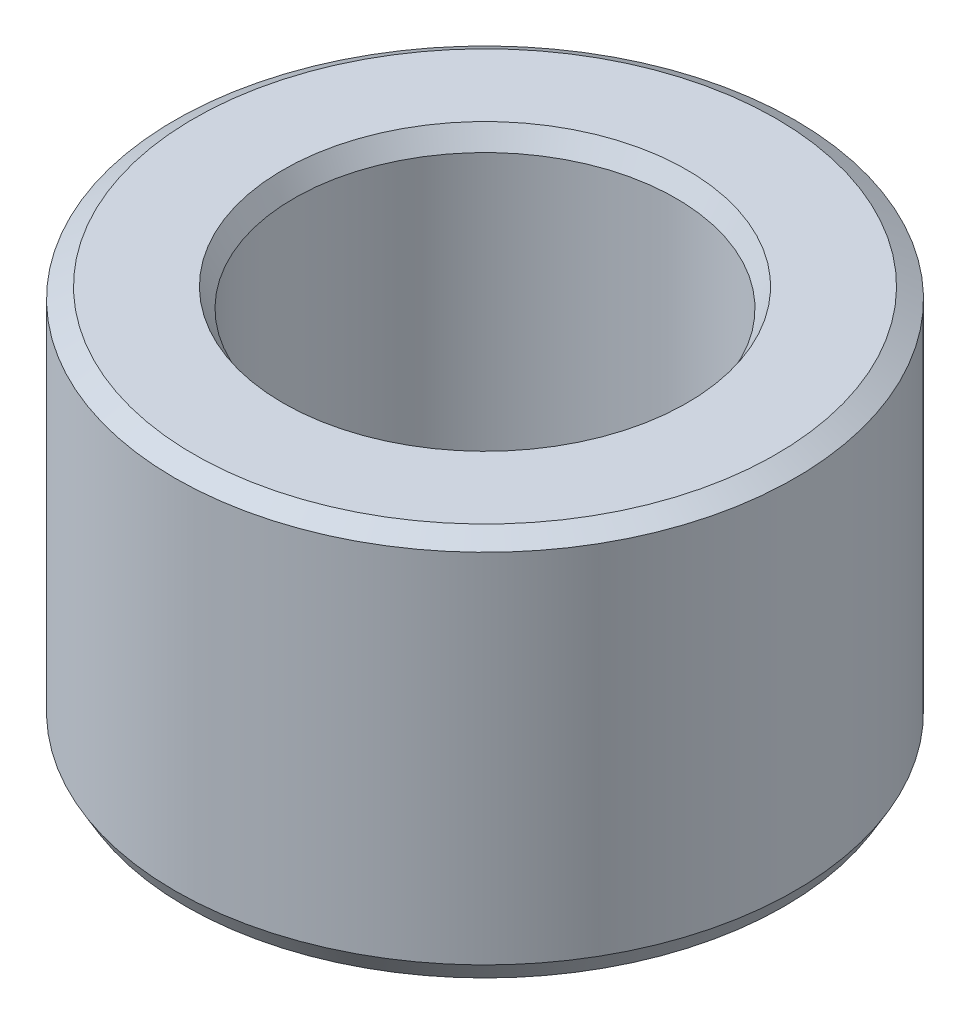
ISO-10303-21;
HEADER;
FILE_DESCRIPTION(('STEP AP214'),'2;1');
FILE_NAME('part.step','',(''),(''),'','','');
FILE_SCHEMA(('AUTOMOTIVE_DESIGN { 1 0 10303 214 1 1 1 1 }'));
ENDSEC;
DATA;
#1=APPLICATION_CONTEXT('core data for automotive mechanical design processes');
#2=APPLICATION_PROTOCOL_DEFINITION('international standard','automotive_design',2000,#1);
#3=PRODUCT_CONTEXT('',#1,'mechanical');
#4=PRODUCT('Part','Part','',(#3));
#5=PRODUCT_RELATED_PRODUCT_CATEGORY('part','',(#4));
#6=PRODUCT_DEFINITION_FORMATION('','',#4);
#7=PRODUCT_DEFINITION_CONTEXT('part definition',#1,'design');
#8=PRODUCT_DEFINITION('design','',#6,#7);
#9=PRODUCT_DEFINITION_SHAPE('','',#8);
#10=(LENGTH_UNIT() NAMED_UNIT(*) SI_UNIT(.MILLI.,.METRE.));
#11=(NAMED_UNIT(*) PLANE_ANGLE_UNIT() SI_UNIT($,.RADIAN.));
#12=(NAMED_UNIT(*) SI_UNIT($,.STERADIAN.) SOLID_ANGLE_UNIT());
#13=UNCERTAINTY_MEASURE_WITH_UNIT(LENGTH_MEASURE(1.E-05),#10,'distance_accuracy_value','');
#14=(GEOMETRIC_REPRESENTATION_CONTEXT(3) GLOBAL_UNCERTAINTY_ASSIGNED_CONTEXT((#13)) GLOBAL_UNIT_ASSIGNED_CONTEXT((#10,
#11,#12)) REPRESENTATION_CONTEXT('',''));
#15=CARTESIAN_POINT('',(0.,0.,0.));
#16=DIRECTION('',(0.,0.,1.));
#17=DIRECTION('',(1.,0.,0.));
#18=AXIS2_PLACEMENT_3D('',#15,#16,#17);
#19=CARTESIAN_POINT('',(0.,62.4750417447808,0.));
#20=DIRECTION('',(0.,-1.,0.));
#21=DIRECTION('',(0.,0.,-1.));
#22=AXIS2_PLACEMENT_3D('',#19,#20,#21);
#23=CYLINDRICAL_SURFACE('',#22,50.);
#24=CARTESIAN_POINT('',(0.,3.07506534951295,0.));
#25=DIRECTION('',(0.,1.,0.));
#26=DIRECTION('',(0.,0.,1.));
#27=AXIS2_PLACEMENT_3D('',#24,#25,#26);
#28=CIRCLE('',#27,50.);
#29=CARTESIAN_POINT('',(0.,3.07506534951295,50.));
#30=VERTEX_POINT('',#29);
#31=EDGE_CURVE('E10',#30,#30,#28,.T.);
#32=ORIENTED_EDGE('',*,*,#31,.T.);
#33=EDGE_LOOP('',(#32));
#34=FACE_BOUND('',#33,.T.);
#35=CARTESIAN_POINT('',(0.,60.6996519374638,0.));
#36=DIRECTION('',(0.,1.,0.));
#37=DIRECTION('',(0.,0.,1.));
#38=AXIS2_PLACEMENT_3D('',#35,#36,#37);
#39=CIRCLE('',#38,50.);
#40=CARTESIAN_POINT('',(0.,60.6996519374638,-50.));
#41=VERTEX_POINT('',#40);
#42=EDGE_CURVE('E50',#41,#41,#39,.F.);
#43=ORIENTED_EDGE('',*,*,#42,.T.);
#44=EDGE_LOOP('',(#43));
#45=FACE_BOUND('',#44,.T.);
#46=ADVANCED_FACE('F39',(#34,#45),#23,.T.);
#47=CARTESIAN_POINT('',(0.,62.4750417447808,0.));
#48=DIRECTION('',(0.,1.,0.));
#49=DIRECTION('',(0.,0.,1.));
#50=AXIS2_PLACEMENT_3D('',#47,#48,#49);
#51=PLANE('',#50);
#52=CARTESIAN_POINT('',(0.,62.4750417447808,0.));
#53=DIRECTION('',(0.,1.,0.));
#54=DIRECTION('',(0.,0.,1.));
#55=AXIS2_PLACEMENT_3D('',#52,#53,#54);
#56=CIRCLE('',#55,32.5654477323633);
#57=CARTESIAN_POINT('',(0.,62.4750417447808,32.5654477323633));
#58=VERTEX_POINT('',#57);
#59=EDGE_CURVE('E58',#58,#58,#56,.F.);
#60=ORIENTED_EDGE('',*,*,#59,.T.);
#61=EDGE_LOOP('',(#60));
#62=FACE_BOUND('',#61,.T.);
#63=CARTESIAN_POINT('',(0.,62.4750417447808,0.));
#64=DIRECTION('',(0.,1.,0.));
#65=DIRECTION('',(0.,0.,1.));
#66=AXIS2_PLACEMENT_3D('',#63,#64,#65);
#67=CIRCLE('',#66,46.9249346504871);
#68=CARTESIAN_POINT('',(0.,62.4750417447808,-46.9249346504871));
#69=VERTEX_POINT('',#68);
#70=EDGE_CURVE('E61',#69,#69,#67,.T.);
#71=ORIENTED_EDGE('',*,*,#70,.T.);
#72=EDGE_LOOP('',(#71));
#73=FACE_BOUND('',#72,.T.);
#74=ADVANCED_FACE('F88',(#62,#73),#51,.T.);
#75=CARTESIAN_POINT('',(0.,0.,0.));
#76=DIRECTION('',(0.,1.,0.));
#77=DIRECTION('',(0.,0.,1.));
#78=AXIS2_PLACEMENT_3D('',#75,#76,#77);
#79=PLANE('',#78);
#80=CARTESIAN_POINT('',(0.,0.,0.));
#81=DIRECTION('',(0.,1.,0.));
#82=DIRECTION('',(0.,0.,1.));
#83=AXIS2_PLACEMENT_3D('',#80,#81,#82);
#84=CIRCLE('',#83,33.8651232745592);
#85=CARTESIAN_POINT('',(0.,0.,33.8651232745592));
#86=VERTEX_POINT('',#85);
#87=EDGE_CURVE('E51',#86,#86,#84,.T.);
#88=ORIENTED_EDGE('',*,*,#87,.T.);
#89=EDGE_LOOP('',(#88));
#90=FACE_BOUND('',#89,.T.);
#91=CARTESIAN_POINT('',(0.,0.,0.));
#92=DIRECTION('',(0.,1.,0.));
#93=DIRECTION('',(0.,0.,1.));
#94=AXIS2_PLACEMENT_3D('',#91,#92,#93);
#95=CIRCLE('',#94,48.224610192683);
#96=CARTESIAN_POINT('',(0.,0.,48.224610192683));
#97=VERTEX_POINT('',#96);
#98=EDGE_CURVE('E54',#97,#97,#95,.F.);
#99=ORIENTED_EDGE('',*,*,#98,.T.);
#100=EDGE_LOOP('',(#99));
#101=FACE_BOUND('',#100,.T.);
#102=ADVANCED_FACE('F83',(#90,#101),#79,.F.);
#103=CARTESIAN_POINT('',(0.,62.4750417447808,0.));
#104=DIRECTION('',(0.,-1.,0.));
#105=DIRECTION('',(0.,0.,-1.));
#106=AXIS2_PLACEMENT_3D('',#103,#104,#105);
#107=CYLINDRICAL_SURFACE('',#106,30.7900579250463);
#108=CARTESIAN_POINT('',(0.,59.3999763952679,0.));
#109=DIRECTION('',(0.,1.,0.));
#110=DIRECTION('',(0.,0.,1.));
#111=AXIS2_PLACEMENT_3D('',#108,#109,#110);
#112=CIRCLE('',#111,30.7900579250463);
#113=CARTESIAN_POINT('',(0.,59.3999763952679,30.7900579250463));
#114=VERTEX_POINT('',#113);
#115=EDGE_CURVE('E67',#114,#114,#112,.T.);
#116=ORIENTED_EDGE('',*,*,#115,.T.);
#117=EDGE_LOOP('',(#116));
#118=FACE_BOUND('',#117,.T.);
#119=CARTESIAN_POINT('',(0.,1.77538980731698,0.));
#120=DIRECTION('',(0.,1.,0.));
#121=DIRECTION('',(0.,0.,1.));
#122=AXIS2_PLACEMENT_3D('',#119,#120,#121);
#123=CIRCLE('',#122,30.7900579250463);
#124=CARTESIAN_POINT('',(0.,1.77538980731698,30.7900579250463));
#125=VERTEX_POINT('',#124);
#126=EDGE_CURVE('E69',#125,#125,#123,.F.);
#127=ORIENTED_EDGE('',*,*,#126,.T.);
#128=EDGE_LOOP('',(#127));
#129=FACE_BOUND('',#128,.T.);
#130=ADVANCED_FACE('F71',(#118,#129),#107,.F.);
#131=CARTESIAN_POINT('',(0.,59.3999763952679,0.));
#132=DIRECTION('',(0.,1.,0.));
#133=DIRECTION('',(0.,0.,1.));
#134=AXIS2_PLACEMENT_3D('',#131,#132,#133);
#135=CONICAL_SURFACE('',#134,30.7900579250463,0.523598775598303);
#136=ORIENTED_EDGE('',*,*,#59,.F.);
#137=EDGE_LOOP('',(#136));
#138=FACE_BOUND('',#137,.T.);
#139=ORIENTED_EDGE('',*,*,#115,.F.);
#140=EDGE_LOOP('',(#139));
#141=FACE_BOUND('',#140,.T.);
#142=ADVANCED_FACE('F77',(#138,#141),#135,.F.);
#143=CARTESIAN_POINT('',(0.,0.,0.));
#144=DIRECTION('',(0.,-1.,0.));
#145=DIRECTION('',(0.,0.,-1.));
#146=AXIS2_PLACEMENT_3D('',#143,#144,#145);
#147=CONICAL_SURFACE('',#146,33.8651232745592,1.04719755119659);
#148=ORIENTED_EDGE('',*,*,#126,.F.);
#149=EDGE_LOOP('',(#148));
#150=FACE_BOUND('',#149,.T.);
#151=ORIENTED_EDGE('',*,*,#87,.F.);
#152=EDGE_LOOP('',(#151));
#153=FACE_BOUND('',#152,.T.);
#154=ADVANCED_FACE('F73',(#150,#153),#147,.F.);
#155=CARTESIAN_POINT('',(0.,3.07506534951295,0.));
#156=DIRECTION('',(0.,1.,0.));
#157=DIRECTION('',(0.,0.,1.));
#158=AXIS2_PLACEMENT_3D('',#155,#156,#157);
#159=CONICAL_SURFACE('',#158,50.,0.523598775598299);
#160=ORIENTED_EDGE('',*,*,#98,.F.);
#161=EDGE_LOOP('',(#160));
#162=FACE_BOUND('',#161,.T.);
#163=ORIENTED_EDGE('',*,*,#31,.F.);
#164=EDGE_LOOP('',(#163));
#165=FACE_BOUND('',#164,.T.);
#166=ADVANCED_FACE('F76',(#162,#165),#159,.T.);
#167=CARTESIAN_POINT('',(0.,62.4750417447808,0.));
#168=DIRECTION('',(0.,-1.,0.));
#169=DIRECTION('',(0.,0.,-1.));
#170=AXIS2_PLACEMENT_3D('',#167,#168,#169);
#171=CONICAL_SURFACE('',#170,46.9249346504871,1.0471975511966);
#172=CARTESIAN_POINT('',(0.,60.6996519374638,-50.));
#173=CARTESIAN_POINT('',(0.,60.71814558129,-49.9679680692759));
#174=CARTESIAN_POINT('',(0.,60.7366392251162,-49.9359361385518));
#175=CARTESIAN_POINT('',(0.,60.7736265127687,-49.8718722771036));
#176=CARTESIAN_POINT('',(0.,60.7921201565949,-49.8398403463795));
#177=CARTESIAN_POINT('',(0.,60.8291074442473,-49.7757764849314));
#178=CARTESIAN_POINT('',(0.,60.8476010880736,-49.7437445542073));
#179=CARTESIAN_POINT('',(0.,60.884588375726,-49.6796806927591));
#180=CARTESIAN_POINT('',(0.,60.9030820195522,-49.647648762035));
#181=CARTESIAN_POINT('',(0.,60.9400693072046,-49.5835849005868));
#182=CARTESIAN_POINT('',(0.,60.9585629510309,-49.5515529698627));
#183=CARTESIAN_POINT('',(0.,60.9955502386833,-49.4874891084145));
#184=CARTESIAN_POINT('',(0.,61.0140438825095,-49.4554571776904));
#185=CARTESIAN_POINT('',(0.,61.051031170162,-49.3913933162423));
#186=CARTESIAN_POINT('',(0.,61.0695248139882,-49.3593613855182));
#187=CARTESIAN_POINT('',(0.,61.1065121016406,-49.29529752407));
#188=CARTESIAN_POINT('',(0.,61.1250057454668,-49.2632655933459));
#189=CARTESIAN_POINT('',(0.,61.1619930331193,-49.1992017318977));
#190=CARTESIAN_POINT('',(0.,61.1804866769455,-49.1671698011736));
#191=CARTESIAN_POINT('',(0.,61.2174739645979,-49.1031059397254));
#192=CARTESIAN_POINT('',(0.,61.2359676084241,-49.0710740090013));
#193=CARTESIAN_POINT('',(0.,61.2729548960766,-49.0070101475531));
#194=CARTESIAN_POINT('',(0.,61.2914485399028,-48.974978216829));
#195=CARTESIAN_POINT('',(0.,61.3284358275552,-48.9109143553809));
#196=CARTESIAN_POINT('',(0.,61.3469294713815,-48.8788824246568));
#197=CARTESIAN_POINT('',(0.,61.3839167590339,-48.8148185632086));
#198=CARTESIAN_POINT('',(0.,61.4024104028601,-48.7827866324845));
#199=CARTESIAN_POINT('',(0.,61.4393976905125,-48.7187227710363));
#200=CARTESIAN_POINT('',(0.,61.4578913343388,-48.6866908403122));
#201=CARTESIAN_POINT('',(0.,61.4948786219912,-48.622626978864));
#202=CARTESIAN_POINT('',(0.,61.5133722658174,-48.5905950481399));
#203=CARTESIAN_POINT('',(0.,61.5503595534698,-48.5265311866917));
#204=CARTESIAN_POINT('',(0.,61.5688531972961,-48.4944992559677));
#205=CARTESIAN_POINT('',(0.,61.6058404849485,-48.4304353945195));
#206=CARTESIAN_POINT('',(0.,61.6243341287747,-48.3984034637954));
#207=CARTESIAN_POINT('',(0.,61.6613214164272,-48.3343396023472));
#208=CARTESIAN_POINT('',(0.,61.6798150602534,-48.3023076716231));
#209=CARTESIAN_POINT('',(0.,61.7168023479058,-48.2382438101749));
#210=CARTESIAN_POINT('',(0.,61.735295991732,-48.2062118794508));
#211=CARTESIAN_POINT('',(0.,61.7722832793845,-48.1421480180026));
#212=CARTESIAN_POINT('',(0.,61.7907769232107,-48.1101160872785));
#213=CARTESIAN_POINT('',(0.,61.8277642108631,-48.0460522258304));
#214=CARTESIAN_POINT('',(0.,61.8462578546893,-48.0140202951063));
#215=CARTESIAN_POINT('',(0.,61.8832451423418,-47.9499564336581));
#216=CARTESIAN_POINT('',(0.,61.901738786168,-47.917924502934));
#217=CARTESIAN_POINT('',(0.,61.9387260738204,-47.8538606414858));
#218=CARTESIAN_POINT('',(0.,61.9572197176467,-47.8218287107617));
#219=CARTESIAN_POINT('',(0.,61.9942070052991,-47.7577648493135));
#220=CARTESIAN_POINT('',(0.,62.0127006491253,-47.7257329185894));
#221=CARTESIAN_POINT('',(0.,62.0496879367777,-47.6616690571412));
#222=CARTESIAN_POINT('',(0.,62.068181580604,-47.6296371264172));
#223=CARTESIAN_POINT('',(0.,62.1051688682564,-47.565573264969));
#224=CARTESIAN_POINT('',(0.,62.1236625120826,-47.5335413342449));
#225=CARTESIAN_POINT('',(0.,62.1606497997351,-47.4694774727967));
#226=CARTESIAN_POINT('',(0.,62.1791434435613,-47.4374455420726));
#227=CARTESIAN_POINT('',(0.,62.2161307312137,-47.3733816806244));
#228=CARTESIAN_POINT('',(0.,62.2346243750399,-47.3413497499003));
#229=CARTESIAN_POINT('',(0.,62.2716116626924,-47.2772858884521));
#230=CARTESIAN_POINT('',(0.,62.2901053065186,-47.245253957728));
#231=CARTESIAN_POINT('',(0.,62.327092594171,-47.1811900962799));
#232=CARTESIAN_POINT('',(0.,62.3455862379972,-47.1491581655558));
#233=CARTESIAN_POINT('',(0.,62.3825735256497,-47.0850943041076));
#234=CARTESIAN_POINT('',(0.,62.4010671694759,-47.0530623733835));
#235=CARTESIAN_POINT('',(0.,62.4380544571283,-46.9889985119353));
#236=CARTESIAN_POINT('',(0.,62.4565481009545,-46.9569665812112));
#237=CARTESIAN_POINT('',(0.,62.4750417447808,-46.9249346504871));
#238=B_SPLINE_CURVE_WITH_KNOTS('',3,(#172,#173,#174,#175,#176,#177,#178,#179,#180,#181,#182,
#183,#184,#185,#186,#187,#188,#189,#190,#191,#192,#193,#194,#195,#196,#197,#198,#199,#200,#201,
#202,#203,#204,#205,#206,#207,#208,#209,#210,#211,#212,#213,#214,#215,#216,#217,#218,#219,#220,
#221,#222,#223,#224,#225,#226,#227,#228,#229,#230,#231,#232,#233,#234,#235,#236,#237),
.UNSPECIFIED.,.F.,.F.,(4,2,2,2,2,2,2,2,2,2,2,2,2,2,2,2,2,2,2,2,2,2,2,2,2,2,2,2,2,2,2,2,4),(0.,
0.110961862957312,0.221923725914621,0.332885588871936,0.443847451829244,0.554809314786553,
0.665771177743862,0.77673304070117,0.887694903658485,0.998656766615794,1.1096186295731,
1.22058049253041,1.33154235548772,1.44250421844503,1.55346608140234,1.66442794435965,
1.77538980731696,1.88635167027427,1.99731353323158,2.1082753961889,2.2192372591462,
2.33019912210351,2.44116098506082,2.55212284801813,2.66308471097544,2.77404657393275,
2.88500843689006,2.99597029984737,3.10693216280468,3.21789402576199,3.3288558887193,
3.43981775167661,3.55077961463392),.UNSPECIFIED.);
#239=EDGE_CURVE('BSEAM45',#41,#69,#238,.T.);
#240=ORIENTED_EDGE('',*,*,#42,.F.);
#241=ORIENTED_EDGE('',*,*,#70,.F.);
#242=ORIENTED_EDGE('',*,*,#239,.T.);
#243=ORIENTED_EDGE('',*,*,#239,.F.);
#244=EDGE_LOOP('',(#240,#242,#241,#243));
#245=FACE_BOUND('',#244,.T.);
#246=ADVANCED_FACE('F45',(#245),#171,.T.);
#247=CLOSED_SHELL('',(#46,#74,#102,#130,#142,#154,#166,#246));
#248=MANIFOLD_SOLID_BREP('B2',#247);
#249=ADVANCED_BREP_SHAPE_REPRESENTATION('',(#18,#248),#14);
#250=SHAPE_DEFINITION_REPRESENTATION(#9,#249);
ENDSEC;
END-ISO-10303-21;
